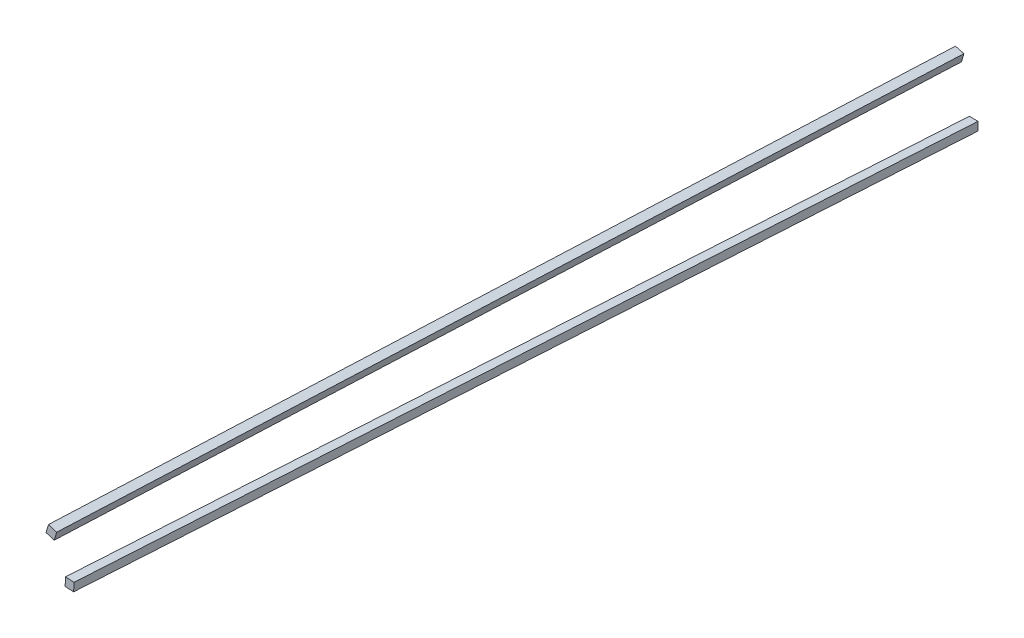
ISO-10303-21;
HEADER;
FILE_DESCRIPTION(('STEP AP214'),'2;1');
FILE_NAME('part.step','',(''),(''),'','','');
FILE_SCHEMA(('AUTOMOTIVE_DESIGN { 1 0 10303 214 1 1 1 1 }'));
ENDSEC;
DATA;
#1=APPLICATION_CONTEXT('core data for automotive mechanical design processes');
#2=APPLICATION_PROTOCOL_DEFINITION('international standard','automotive_design',2000,#1);
#3=PRODUCT_CONTEXT('',#1,'mechanical');
#4=PRODUCT('Part','Part','',(#3));
#5=PRODUCT_RELATED_PRODUCT_CATEGORY('part','',(#4));
#6=PRODUCT_DEFINITION_FORMATION('','',#4);
#7=PRODUCT_DEFINITION_CONTEXT('part definition',#1,'design');
#8=PRODUCT_DEFINITION('design','',#6,#7);
#9=PRODUCT_DEFINITION_SHAPE('','',#8);
#10=(LENGTH_UNIT() NAMED_UNIT(*) SI_UNIT(.MILLI.,.METRE.));
#11=(NAMED_UNIT(*) PLANE_ANGLE_UNIT() SI_UNIT($,.RADIAN.));
#12=(NAMED_UNIT(*) SI_UNIT($,.STERADIAN.) SOLID_ANGLE_UNIT());
#13=UNCERTAINTY_MEASURE_WITH_UNIT(LENGTH_MEASURE(1.E-05),#10,'distance_accuracy_value','');
#14=(GEOMETRIC_REPRESENTATION_CONTEXT(3) GLOBAL_UNCERTAINTY_ASSIGNED_CONTEXT((#13)) GLOBAL_UNIT_ASSIGNED_CONTEXT((#10,
#11,#12)) REPRESENTATION_CONTEXT('',''));
#15=CARTESIAN_POINT('',(0.,0.,0.));
#16=DIRECTION('',(0.,0.,1.));
#17=DIRECTION('',(1.,0.,0.));
#18=AXIS2_PLACEMENT_3D('',#15,#16,#17);
#19=CARTESIAN_POINT('',(0.,0.,0.));
#20=DIRECTION('',(0.,0.,-1.));
#21=DIRECTION('',(1.,0.,0.));
#22=AXIS2_PLACEMENT_3D('',#19,#20,#21);
#23=PLANE('',#22);
#24=CARTESIAN_POINT('',(395.313487892718,13.9070974360647,0.));
#25=CARTESIAN_POINT('',(395.311487083007,13.1133499577944,0.));
#26=CARTESIAN_POINT('',(395.309486273296,12.3196024795241,0.));
#27=CARTESIAN_POINT('',(395.305484653873,10.7321075229834,0.));
#28=CARTESIAN_POINT('',(395.303483844162,9.9383600447131,0.));
#29=CARTESIAN_POINT('',(395.301483034451,9.1446125664428,0.));
#30=B_SPLINE_CURVE_WITH_KNOTS('',3,(#24,#25,#26,#27,#28,#29),.UNSPECIFIED.,.F.,.F.,(4,2,4),(0.,
0.5,1.),.UNSPECIFIED.);
#31=CARTESIAN_POINT('',(395.301483034451,9.1446125664428,0.));
#32=VERTEX_POINT('',#31);
#33=CARTESIAN_POINT('',(395.313487892718,13.9070974360647,0.));
#34=VERTEX_POINT('',#33);
#35=EDGE_CURVE('E242',#32,#34,#30,.F.);
#36=ORIENTED_EDGE('',*,*,#35,.T.);
#37=CARTESIAN_POINT('',(400.075514439656,13.8399452487994,0.));
#38=CARTESIAN_POINT('',(399.281843348501,13.8511372800103,0.));
#39=CARTESIAN_POINT('',(398.488172257344,13.8623293112212,0.));
#40=CARTESIAN_POINT('',(396.900830075032,13.884713373643,0.));
#41=CARTESIAN_POINT('',(396.107158983875,13.8959054048538,0.));
#42=CARTESIAN_POINT('',(395.313487892718,13.9070974360647,0.));
#43=B_SPLINE_CURVE_WITH_KNOTS('',3,(#37,#38,#39,#40,#41,#42),.UNSPECIFIED.,.F.,.F.,(4,2,4),(0.,
0.5,1.),.UNSPECIFIED.);
#44=CARTESIAN_POINT('',(400.075514439656,13.8399452487994,0.));
#45=VERTEX_POINT('',#44);
#46=EDGE_CURVE('E13',#34,#45,#43,.F.);
#47=ORIENTED_EDGE('',*,*,#46,.T.);
#48=CARTESIAN_POINT('',(400.008751573171,9.10552651261769,0.));
#49=CARTESIAN_POINT('',(400.019878717586,9.89459630198132,0.));
#50=CARTESIAN_POINT('',(400.031005862,10.6836660913449,0.));
#51=CARTESIAN_POINT('',(400.053260150828,12.2618056700722,0.));
#52=CARTESIAN_POINT('',(400.064387295242,13.0508754594358,0.));
#53=CARTESIAN_POINT('',(400.075514439656,13.8399452487994,0.));
#54=B_SPLINE_CURVE_WITH_KNOTS('',3,(#48,#49,#50,#51,#52,#53),.UNSPECIFIED.,.F.,.F.,(4,2,4),(0.,
0.5,1.),.UNSPECIFIED.);
#55=CARTESIAN_POINT('',(400.008751573171,9.10552651261769,0.));
#56=VERTEX_POINT('',#55);
#57=EDGE_CURVE('E111',#45,#56,#54,.F.);
#58=ORIENTED_EDGE('',*,*,#57,.T.);
#59=CARTESIAN_POINT('',(395.301483034451,9.1446125664428,0.));
#60=CARTESIAN_POINT('',(396.086027790904,9.13809822413861,0.));
#61=CARTESIAN_POINT('',(396.870572547357,9.13158388183443,0.));
#62=CARTESIAN_POINT('',(398.439662060264,9.11855519722606,0.));
#63=CARTESIAN_POINT('',(399.224206816718,9.11204085492187,0.));
#64=CARTESIAN_POINT('',(400.008751573171,9.10552651261769,0.));
#65=B_SPLINE_CURVE_WITH_KNOTS('',3,(#59,#60,#61,#62,#63,#64),.UNSPECIFIED.,.F.,.F.,(4,2,4),(0.,
0.5,1.),.UNSPECIFIED.);
#66=EDGE_CURVE('E234',#32,#56,#65,.T.);
#67=ORIENTED_EDGE('',*,*,#66,.F.);
#68=EDGE_LOOP('',(#36,#47,#58,#67));
#69=FACE_BOUND('',#68,.T.);
#70=ADVANCED_FACE('F101',(#69),#23,.T.);
#71=CARTESIAN_POINT('',(0.,0.,469.138));
#72=DIRECTION('',(0.,0.,1.));
#73=DIRECTION('',(-1.,0.,0.));
#74=AXIS2_PLACEMENT_3D('',#71,#72,#73);
#75=PLANE('',#74);
#76=CARTESIAN_POINT('',(368.242335537773,6.77416686357147,469.138));
#77=CARTESIAN_POINT('',(367.460761179371,6.80971652101153,469.138));
#78=CARTESIAN_POINT('',(366.679186820969,6.84526617845159,469.138));
#79=CARTESIAN_POINT('',(365.116038104166,6.91636549333171,469.138));
#80=CARTESIAN_POINT('',(364.334463745764,6.95191515077178,469.138));
#81=CARTESIAN_POINT('',(363.552889387363,6.98746480821184,469.138));
#82=B_SPLINE_CURVE_WITH_KNOTS('',3,(#76,#77,#78,#79,#80,#81),.UNSPECIFIED.,.F.,.F.,(4,2,4),(0.,
0.5,1.),.UNSPECIFIED.);
#83=CARTESIAN_POINT('',(363.552889379196,6.98746480852441,469.138));
#84=VERTEX_POINT('',#83);
#85=CARTESIAN_POINT('',(368.242335537775,6.7741668636307,469.138));
#86=VERTEX_POINT('',#85);
#87=EDGE_CURVE('E165',#84,#86,#82,.F.);
#88=ORIENTED_EDGE('',*,*,#87,.T.);
#89=CARTESIAN_POINT('',(368.490941641371,11.4960846967993,469.138));
#90=CARTESIAN_POINT('',(368.449507290771,10.7090983912713,469.138));
#91=CARTESIAN_POINT('',(368.408072940172,9.92211208574317,469.138));
#92=CARTESIAN_POINT('',(368.325204238974,8.34813947468696,469.138));
#93=CARTESIAN_POINT('',(368.283769888375,7.56115316915884,469.138));
#94=CARTESIAN_POINT('',(368.242335537775,6.7741668636307,469.138));
#95=B_SPLINE_CURVE_WITH_KNOTS('',3,(#89,#90,#91,#92,#93,#94),.UNSPECIFIED.,.F.,.F.,(4,2,4),(0.,
0.5,1.),.UNSPECIFIED.);
#96=CARTESIAN_POINT('',(368.490941641371,11.4960846967993,469.138));
#97=VERTEX_POINT('',#96);
#98=EDGE_CURVE('E146',#86,#97,#95,.F.);
#99=ORIENTED_EDGE('',*,*,#98,.T.);
#100=CARTESIAN_POINT('',(363.735028676447,11.7464806234169,469.138));
#101=CARTESIAN_POINT('',(364.527680837267,11.7047479689807,469.138));
#102=CARTESIAN_POINT('',(365.320332998087,11.6630153145444,469.138));
#103=CARTESIAN_POINT('',(366.905637319729,11.5795500056719,469.138));
#104=CARTESIAN_POINT('',(367.69828948055,11.5378173512356,469.138));
#105=CARTESIAN_POINT('',(368.490941641371,11.4960846967993,469.138));
#106=B_SPLINE_CURVE_WITH_KNOTS('',3,(#100,#101,#102,#103,#104,#105),.UNSPECIFIED.,.F.,.F.,(4,2,
4),(0.,0.5,1.),.UNSPECIFIED.);
#107=CARTESIAN_POINT('',(363.735028676447,11.7464806234169,469.138));
#108=VERTEX_POINT('',#107);
#109=EDGE_CURVE('E153',#97,#108,#106,.F.);
#110=ORIENTED_EDGE('',*,*,#109,.T.);
#111=CARTESIAN_POINT('',(363.552889379196,6.98746480852441,469.138));
#112=CARTESIAN_POINT('',(363.583245928738,7.7806341110065,469.138));
#113=CARTESIAN_POINT('',(363.613602478279,8.57380341348858,469.138));
#114=CARTESIAN_POINT('',(363.674315577363,10.1601420184528,469.138));
#115=CARTESIAN_POINT('',(363.704672126905,10.9533113209348,469.138));
#116=CARTESIAN_POINT('',(363.735028676447,11.7464806234169,469.138));
#117=B_SPLINE_CURVE_WITH_KNOTS('',3,(#111,#112,#113,#114,#115,#116),.UNSPECIFIED.,.F.,.F.,(4,2,
4),(0.,0.5,1.),.UNSPECIFIED.);
#118=EDGE_CURVE('E159',#108,#84,#117,.F.);
#119=ORIENTED_EDGE('',*,*,#118,.T.);
#120=EDGE_LOOP('',(#88,#99,#110,#119));
#121=FACE_BOUND('',#120,.T.);
#122=ADVANCED_FACE('F163',(#121),#75,.T.);
#123=CARTESIAN_POINT('',(368.490941641371,11.4960846967993,469.138));
#124=CARTESIAN_POINT('',(400.075514439656,13.8399452487994,0.));
#125=CARTESIAN_POINT('',(367.69828948055,11.5378173512356,469.138));
#126=CARTESIAN_POINT('',(399.281843348501,13.8511372800103,0.));
#127=CARTESIAN_POINT('',(366.905637319729,11.5795500056719,469.138));
#128=CARTESIAN_POINT('',(398.488172257344,13.8623293112212,0.));
#129=CARTESIAN_POINT('',(365.320332998087,11.6630153145444,469.138));
#130=CARTESIAN_POINT('',(396.900830075032,13.884713373643,0.));
#131=CARTESIAN_POINT('',(364.527680837267,11.7047479689807,469.138));
#132=CARTESIAN_POINT('',(396.107158983875,13.8959054048538,0.));
#133=CARTESIAN_POINT('',(363.735028676447,11.7464806234169,469.138));
#134=CARTESIAN_POINT('',(395.313487892718,13.9070974360647,0.));
#135=B_SPLINE_SURFACE_WITH_KNOTS('',3,1,((#123,#124),(#125,#126),(#127,#128),(#129,#130),(#131,
#132),(#133,#134)),.UNSPECIFIED.,.F.,.F.,.F.,(4,2,4),(2,2),(0.,0.5,1.),(0.,1.),.UNSPECIFIED.);
#136=DIRECTION('',(-0.0671717988112607,-0.00498475412177002,0.997728972051431));
#137=VECTOR('',#136,1.);
#138=CARTESIAN_POINT('',(384.283228040514,12.6680149727994,234.569));
#139=LINE('',#138,#137);
#140=EDGE_CURVE('E125',#45,#97,#139,.T.);
#141=DIRECTION('',(0.0671589808969115,0.00459505710055014,-0.99773170578825));
#142=VECTOR('',#141,1.);
#143=CARTESIAN_POINT('',(379.524258284582,12.8267890297408,234.569));
#144=LINE('',#143,#142);
#145=EDGE_CURVE('E118',#108,#34,#144,.T.);
#146=ORIENTED_EDGE('',*,*,#109,.F.);
#147=ORIENTED_EDGE('',*,*,#140,.F.);
#148=ORIENTED_EDGE('',*,*,#46,.F.);
#149=ORIENTED_EDGE('',*,*,#145,.F.);
#150=EDGE_LOOP('',(#146,#147,#148,#149));
#151=FACE_BOUND('',#150,.T.);
#152=ADVANCED_FACE('F155',(#151),#135,.F.);
#153=CARTESIAN_POINT('',(363.735028676447,11.7464806234169,469.138));
#154=CARTESIAN_POINT('',(395.313487892718,13.9070974360647,0.));
#155=CARTESIAN_POINT('',(363.704672126905,10.9533113209348,469.138));
#156=CARTESIAN_POINT('',(395.311487083007,13.1133499577944,0.));
#157=CARTESIAN_POINT('',(363.674315577363,10.1601420184528,469.138));
#158=CARTESIAN_POINT('',(395.309486273296,12.3196024795241,0.));
#159=CARTESIAN_POINT('',(363.613602478279,8.57380341348858,469.138));
#160=CARTESIAN_POINT('',(395.305484653873,10.7321075229834,0.));
#161=CARTESIAN_POINT('',(363.583245928738,7.7806341110065,469.138));
#162=CARTESIAN_POINT('',(395.303483844162,9.9383600447131,0.));
#163=CARTESIAN_POINT('',(363.552889379196,6.98746480852441,469.138));
#164=CARTESIAN_POINT('',(395.301483034451,9.1446125664428,0.));
#165=B_SPLINE_SURFACE_WITH_KNOTS('',3,1,((#153,#154),(#155,#156),(#157,#158),(#159,#160),(#161,
#162),(#163,#164)),.UNSPECIFIED.,.F.,.F.,.F.,(4,2,4),(2,2),(0.,0.5,1.),(0.,1.),.UNSPECIFIED.);
#166=DIRECTION('',(0.067519168741487,0.0045875677218573,-0.997707430099052));
#167=VECTOR('',#166,1.);
#168=CARTESIAN_POINT('',(379.427186206823,8.0660386874836,234.569));
#169=LINE('',#168,#167);
#170=EDGE_CURVE('E245',#84,#32,#169,.T.);
#171=ORIENTED_EDGE('',*,*,#118,.F.);
#172=ORIENTED_EDGE('',*,*,#145,.T.);
#173=ORIENTED_EDGE('',*,*,#35,.F.);
#174=ORIENTED_EDGE('',*,*,#170,.F.);
#175=EDGE_LOOP('',(#171,#172,#173,#174));
#176=FACE_BOUND('',#175,.T.);
#177=ADVANCED_FACE('F264',(#176),#165,.F.);
#178=CARTESIAN_POINT('',(368.242335537775,6.7741668636307,469.138));
#179=CARTESIAN_POINT('',(400.008751573171,9.10552651261769,0.));
#180=CARTESIAN_POINT('',(368.283769888375,7.56115316915884,469.138));
#181=CARTESIAN_POINT('',(400.019878717586,9.89459630198132,0.));
#182=CARTESIAN_POINT('',(368.325204238974,8.34813947468696,469.138));
#183=CARTESIAN_POINT('',(400.031005862,10.6836660913449,0.));
#184=CARTESIAN_POINT('',(368.408072940172,9.92211208574317,469.138));
#185=CARTESIAN_POINT('',(400.053260150828,12.2618056700722,0.));
#186=CARTESIAN_POINT('',(368.449507290771,10.7090983912713,469.138));
#187=CARTESIAN_POINT('',(400.064387295242,13.0508754594358,0.));
#188=CARTESIAN_POINT('',(368.490941641371,11.4960846967993,469.138));
#189=CARTESIAN_POINT('',(400.075514439656,13.8399452487994,0.));
#190=B_SPLINE_SURFACE_WITH_KNOTS('',3,1,((#178,#179),(#180,#181),(#182,#183),(#184,#185),(#186,
#187),(#188,#189)),.UNSPECIFIED.,.F.,.F.,.F.,(4,2,4),(2,2),(0.,0.5,1.),(0.,1.),.UNSPECIFIED.);
#191=DIRECTION('',(0.067556778883899,0.0049580395891671,-0.997703111887632));
#192=VECTOR('',#191,1.);
#193=CARTESIAN_POINT('',(384.125543555472,7.93984668809458,234.569));
#194=LINE('',#193,#192);
#195=EDGE_CURVE('E244',#86,#56,#194,.T.);
#196=ORIENTED_EDGE('',*,*,#98,.F.);
#197=ORIENTED_EDGE('',*,*,#195,.T.);
#198=ORIENTED_EDGE('',*,*,#57,.F.);
#199=ORIENTED_EDGE('',*,*,#140,.T.);
#200=EDGE_LOOP('',(#196,#197,#198,#199));
#201=FACE_BOUND('',#200,.T.);
#202=ADVANCED_FACE('F144',(#201),#190,.F.);
#203=CARTESIAN_POINT('',(363.552889387363,6.98746480821184,469.138));
#204=CARTESIAN_POINT('',(395.301483034451,9.1446125664428,0.));
#205=CARTESIAN_POINT('',(364.334463745764,6.95191515077178,469.138));
#206=CARTESIAN_POINT('',(396.086027790904,9.13809822413861,0.));
#207=CARTESIAN_POINT('',(365.116038104166,6.91636549333171,469.138));
#208=CARTESIAN_POINT('',(396.870572547357,9.13158388183443,0.));
#209=CARTESIAN_POINT('',(366.679186820969,6.84526617845159,469.138));
#210=CARTESIAN_POINT('',(398.439662060264,9.11855519722606,0.));
#211=CARTESIAN_POINT('',(367.460761179371,6.80971652101153,469.138));
#212=CARTESIAN_POINT('',(399.224206816718,9.11204085492187,0.));
#213=CARTESIAN_POINT('',(368.242335537773,6.77416686357147,469.138));
#214=CARTESIAN_POINT('',(400.008751573171,9.10552651261769,0.));
#215=B_SPLINE_SURFACE_WITH_KNOTS('',3,1,((#203,#204),(#205,#206),(#207,#208),(#209,#210),(#211,
#212),(#213,#214)),.UNSPECIFIED.,.F.,.F.,.F.,(4,2,4),(2,2),(0.,0.5,1.),(0.,1.),.UNSPECIFIED.);
#216=ORIENTED_EDGE('',*,*,#87,.F.);
#217=ORIENTED_EDGE('',*,*,#170,.T.);
#218=ORIENTED_EDGE('',*,*,#66,.T.);
#219=ORIENTED_EDGE('',*,*,#195,.F.);
#220=EDGE_LOOP('',(#216,#217,#218,#219));
#221=FACE_BOUND('',#220,.T.);
#222=ADVANCED_FACE('F263',(#221),#215,.F.);
#223=CLOSED_SHELL('',(#70,#122,#152,#177,#202,#222));
#224=MANIFOLD_SOLID_BREP('B2',#223);
#225=CARTESIAN_POINT('',(0.,0.,0.));
#226=DIRECTION('',(0.,0.,-1.));
#227=DIRECTION('',(1.,0.,0.));
#228=AXIS2_PLACEMENT_3D('',#225,#226,#227);
#229=PLANE('',#228);
#230=CARTESIAN_POINT('',(392.246798260659,42.3975737675759,0.));
#231=CARTESIAN_POINT('',(391.4710230142,42.611059847223,0.));
#232=CARTESIAN_POINT('',(390.695247767741,42.82454592687,0.));
#233=CARTESIAN_POINT('',(389.143697274823,43.251518086164,0.));
#234=CARTESIAN_POINT('',(388.367922028364,43.4650041658109,0.));
#235=CARTESIAN_POINT('',(387.592146781905,43.6784902454578,0.));
#236=B_SPLINE_CURVE_WITH_KNOTS('',3,(#230,#231,#232,#233,#234,#235),.UNSPECIFIED.,.F.,.F.,(4,2,
4),(0.,0.5,1.),.UNSPECIFIED.);
#237=CARTESIAN_POINT('',(387.592146781905,43.6784902454578,0.));
#238=VERTEX_POINT('',#237);
#239=CARTESIAN_POINT('',(392.246798260659,42.3975737675759,0.));
#240=VERTEX_POINT('',#239);
#241=EDGE_CURVE('E579',#238,#240,#236,.F.);
#242=ORIENTED_EDGE('',*,*,#241,.T.);
#243=CARTESIAN_POINT('',(390.960475862964,37.8460660672843,0.));
#244=CARTESIAN_POINT('',(391.174862929247,38.6046506839998,0.));
#245=CARTESIAN_POINT('',(391.389249995529,39.3632353007152,0.));
#246=CARTESIAN_POINT('',(391.818024128094,40.8804045341457,0.));
#247=CARTESIAN_POINT('',(392.032411194377,41.6389891508608,0.));
#248=CARTESIAN_POINT('',(392.246798260659,42.3975737675759,0.));
#249=B_SPLINE_CURVE_WITH_KNOTS('',3,(#243,#244,#245,#246,#247,#248),.UNSPECIFIED.,.F.,.F.,(4,2,
4),(0.,0.5,1.),.UNSPECIFIED.);
#250=CARTESIAN_POINT('',(390.960475862964,37.8460660672843,0.));
#251=VERTEX_POINT('',#250);
#252=EDGE_CURVE('E99',#251,#240,#249,.T.);
#253=ORIENTED_EDGE('',*,*,#252,.F.);
#254=CARTESIAN_POINT('',(386.360099239292,39.0781136192739,0.));
#255=CARTESIAN_POINT('',(387.126828676571,38.8727723606088,0.));
#256=CARTESIAN_POINT('',(387.89355811385,38.6674311019438,0.));
#257=CARTESIAN_POINT('',(389.427016988408,38.256748584614,0.));
#258=CARTESIAN_POINT('',(390.193746425686,38.0514073259491,0.));
#259=CARTESIAN_POINT('',(390.960475862964,37.8460660672843,0.));
#260=B_SPLINE_CURVE_WITH_KNOTS('',3,(#254,#255,#256,#257,#258,#259),.UNSPECIFIED.,.F.,.F.,(4,2,
4),(0.,0.5,1.),.UNSPECIFIED.);
#261=CARTESIAN_POINT('',(386.360099239292,39.078113619274,0.));
#262=VERTEX_POINT('',#261);
#263=EDGE_CURVE('E444',#262,#251,#260,.T.);
#264=ORIENTED_EDGE('',*,*,#263,.F.);
#265=CARTESIAN_POINT('',(387.592146781905,43.6784902454578,0.));
#266=CARTESIAN_POINT('',(387.386805524803,42.9117608077606,0.));
#267=CARTESIAN_POINT('',(387.181464267701,42.1450313700633,0.));
#268=CARTESIAN_POINT('',(386.770781753496,40.6115724946687,0.));
#269=CARTESIAN_POINT('',(386.565440496394,39.8448430569714,0.));
#270=CARTESIAN_POINT('',(386.360099239292,39.078113619274,0.));
#271=B_SPLINE_CURVE_WITH_KNOTS('',3,(#265,#266,#267,#268,#269,#270),.UNSPECIFIED.,.F.,.F.,(4,2,
4),(0.,0.5,1.),.UNSPECIFIED.);
#272=EDGE_CURVE('E485',#238,#262,#271,.T.);
#273=ORIENTED_EDGE('',*,*,#272,.F.);
#274=EDGE_LOOP('',(#242,#253,#264,#273));
#275=FACE_BOUND('',#274,.T.);
#276=ADVANCED_FACE('F434',(#275),#229,.T.);
#277=CARTESIAN_POINT('',(0.,0.,469.138));
#278=DIRECTION('',(0.,0.,1.));
#279=DIRECTION('',(-1.,0.,0.));
#280=AXIS2_PLACEMENT_3D('',#277,#278,#279);
#281=PLANE('',#280);
#282=CARTESIAN_POINT('',(354.3208374344,32.1244273965259,469.138));
#283=CARTESIAN_POINT('',(355.07880983132,31.888709410133,469.138));
#284=CARTESIAN_POINT('',(355.83678222824,31.6529914237401,469.138));
#285=CARTESIAN_POINT('',(357.35272702208,31.1815554509543,469.138));
#286=CARTESIAN_POINT('',(358.110699419001,30.9458374645614,469.138));
#287=CARTESIAN_POINT('',(358.868671815921,30.7101194781685,469.138));
#288=B_SPLINE_CURVE_WITH_KNOTS('',3,(#282,#283,#284,#285,#286,#287),.UNSPECIFIED.,.F.,.F.,(4,2,
4),(0.,0.5,1.),.UNSPECIFIED.);
#289=CARTESIAN_POINT('',(358.868671815921,30.7101194781685,469.138));
#290=VERTEX_POINT('',#289);
#291=CARTESIAN_POINT('',(354.32083743442,32.1244273965907,469.138));
#292=VERTEX_POINT('',#291);
#293=EDGE_CURVE('E503',#290,#292,#288,.F.);
#294=ORIENTED_EDGE('',*,*,#293,.T.);
#295=CARTESIAN_POINT('',(352.945516306707,27.5648333307044,469.138));
#296=CARTESIAN_POINT('',(353.174736494659,28.3247656750187,469.138));
#297=CARTESIAN_POINT('',(353.403956682611,29.0846980193331,469.138));
#298=CARTESIAN_POINT('',(353.862397058516,30.6045627079619,469.138));
#299=CARTESIAN_POINT('',(354.091617246468,31.3644950522763,469.138));
#300=CARTESIAN_POINT('',(354.32083743442,32.1244273965907,469.138));
#301=B_SPLINE_CURVE_WITH_KNOTS('',3,(#295,#296,#297,#298,#299,#300),.UNSPECIFIED.,.F.,.F.,(4,2,
4),(0.,0.5,1.),.UNSPECIFIED.);
#302=CARTESIAN_POINT('',(352.945516306707,27.5648333307043,469.138));
#303=VERTEX_POINT('',#302);
#304=EDGE_CURVE('E481',#292,#303,#301,.F.);
#305=ORIENTED_EDGE('',*,*,#304,.T.);
#306=CARTESIAN_POINT('',(357.505110372594,26.1895122029914,469.138));
#307=CARTESIAN_POINT('',(356.745178028279,26.4187323909436,469.138));
#308=CARTESIAN_POINT('',(355.985245683965,26.6479525788957,469.138));
#309=CARTESIAN_POINT('',(354.465380995336,27.1063929548,469.138));
#310=CARTESIAN_POINT('',(353.705448651022,27.3356131427522,469.138));
#311=CARTESIAN_POINT('',(352.945516306707,27.5648333307043,469.138));
#312=B_SPLINE_CURVE_WITH_KNOTS('',3,(#306,#307,#308,#309,#310,#311),.UNSPECIFIED.,.F.,.F.,(4,2,
4),(0.,0.5,1.),.UNSPECIFIED.);
#313=CARTESIAN_POINT('',(357.505110372594,26.1895122029914,469.138));
#314=VERTEX_POINT('',#313);
#315=EDGE_CURVE('E492',#303,#314,#312,.F.);
#316=ORIENTED_EDGE('',*,*,#315,.T.);
#317=CARTESIAN_POINT('',(358.868671821987,30.7101194763388,469.138));
#318=CARTESIAN_POINT('',(358.641411580422,29.9566849307809,469.138));
#319=CARTESIAN_POINT('',(358.414151338856,29.203250385223,469.138));
#320=CARTESIAN_POINT('',(357.959630855725,27.6963812941073,469.138));
#321=CARTESIAN_POINT('',(357.732370614159,26.9429467485494,469.138));
#322=CARTESIAN_POINT('',(357.505110372593,26.1895122029915,469.138));
#323=B_SPLINE_CURVE_WITH_KNOTS('',3,(#317,#318,#319,#320,#321,#322),.UNSPECIFIED.,.F.,.F.,(4,2,
4),(0.,0.5,1.),.UNSPECIFIED.);
#324=EDGE_CURVE('E498',#314,#290,#323,.F.);
#325=ORIENTED_EDGE('',*,*,#324,.T.);
#326=EDGE_LOOP('',(#294,#305,#316,#325));
#327=FACE_BOUND('',#326,.T.);
#328=ADVANCED_FACE('F502',(#327),#281,.T.);
#329=CARTESIAN_POINT('',(358.868671815921,30.7101194781685,469.138));
#330=CARTESIAN_POINT('',(392.246798260659,42.3975737675759,0.));
#331=CARTESIAN_POINT('',(358.110699419001,30.9458374645614,469.138));
#332=CARTESIAN_POINT('',(391.4710230142,42.611059847223,0.));
#333=CARTESIAN_POINT('',(357.35272702208,31.1815554509543,469.138));
#334=CARTESIAN_POINT('',(390.695247767741,42.82454592687,0.));
#335=CARTESIAN_POINT('',(355.83678222824,31.6529914237401,469.138));
#336=CARTESIAN_POINT('',(389.143697274823,43.251518086164,0.));
#337=CARTESIAN_POINT('',(355.07880983132,31.888709410133,469.138));
#338=CARTESIAN_POINT('',(388.367922028364,43.4650041658109,0.));
#339=CARTESIAN_POINT('',(354.3208374344,32.1244273965259,469.138));
#340=CARTESIAN_POINT('',(387.592146781905,43.6784902454578,0.));
#341=B_SPLINE_SURFACE_WITH_KNOTS('',3,1,((#329,#330),(#331,#332),(#333,#334),(#335,#336),(#337,
#338),(#339,#340)),.UNSPECIFIED.,.F.,.F.,.F.,(4,2,4),(2,2),(0.,0.5,1.),(0.,1.),.UNSPECIFIED.);
#342=DIRECTION('',(-0.0709464821029257,-0.0248421303078536,0.997170730235794));
#343=VECTOR('',#342,1.);
#344=CARTESIAN_POINT('',(375.55773503829,36.5538466228722,234.569));
#345=LINE('',#344,#343);
#346=EDGE_CURVE('E451',#240,#290,#345,.T.);
#347=DIRECTION('',(0.0707210709308886,0.0245591686742715,-0.997193751163943));
#348=VECTOR('',#347,1.);
#349=CARTESIAN_POINT('',(370.956492108153,37.9014588209918,234.569));
#350=LINE('',#349,#348);
#351=EDGE_CURVE('E489',#292,#238,#350,.T.);
#352=ORIENTED_EDGE('',*,*,#293,.F.);
#353=ORIENTED_EDGE('',*,*,#346,.F.);
#354=ORIENTED_EDGE('',*,*,#241,.F.);
#355=ORIENTED_EDGE('',*,*,#351,.F.);
#356=EDGE_LOOP('',(#352,#353,#354,#355));
#357=FACE_BOUND('',#356,.T.);
#358=ADVANCED_FACE('F522',(#357),#341,.F.);
#359=CARTESIAN_POINT('',(354.32083743442,32.1244273965907,469.138));
#360=CARTESIAN_POINT('',(387.592146781905,43.6784902454578,0.));
#361=CARTESIAN_POINT('',(354.091617246468,31.3644950522763,469.138));
#362=CARTESIAN_POINT('',(387.386805524803,42.9117608077606,0.));
#363=CARTESIAN_POINT('',(353.862397058516,30.6045627079619,469.138));
#364=CARTESIAN_POINT('',(387.181464267701,42.1450313700633,0.));
#365=CARTESIAN_POINT('',(353.403956682611,29.0846980193331,469.138));
#366=CARTESIAN_POINT('',(386.770781753496,40.6115724946687,0.));
#367=CARTESIAN_POINT('',(353.174736494659,28.3247656750187,469.138));
#368=CARTESIAN_POINT('',(386.565440496394,39.8448430569714,0.));
#369=CARTESIAN_POINT('',(352.945516306707,27.5648333307044,469.138));
#370=CARTESIAN_POINT('',(386.360099239292,39.078113619274,0.));
#371=B_SPLINE_SURFACE_WITH_KNOTS('',3,1,((#359,#360),(#361,#362),(#363,#364),(#365,#366),(#367,
#368),(#369,#370)),.UNSPECIFIED.,.F.,.F.,.F.,(4,2,4),(2,2),(0.,0.5,1.),(0.,1.),.UNSPECIFIED.);
#372=DIRECTION('',(0.0710242294177518,0.0244720055975575,-0.997174347733458));
#373=VECTOR('',#372,1.);
#374=CARTESIAN_POINT('',(369.652807772999,33.3214734749892,234.569));
#375=LINE('',#374,#373);
#376=EDGE_CURVE('E477',#303,#262,#375,.T.);
#377=ORIENTED_EDGE('',*,*,#304,.F.);
#378=ORIENTED_EDGE('',*,*,#351,.T.);
#379=ORIENTED_EDGE('',*,*,#272,.T.);
#380=ORIENTED_EDGE('',*,*,#376,.F.);
#381=EDGE_LOOP('',(#377,#378,#379,#380));
#382=FACE_BOUND('',#381,.T.);
#383=ADVANCED_FACE('F479',(#382),#371,.F.);
#384=CARTESIAN_POINT('',(357.505110372593,26.1895122029915,469.138));
#385=CARTESIAN_POINT('',(390.960475862964,37.8460660672843,0.));
#386=CARTESIAN_POINT('',(357.732370614159,26.9429467485494,469.138));
#387=CARTESIAN_POINT('',(391.174862929247,38.6046506839998,0.));
#388=CARTESIAN_POINT('',(357.959630855725,27.6963812941073,469.138));
#389=CARTESIAN_POINT('',(391.389249995529,39.3632353007152,0.));
#390=CARTESIAN_POINT('',(358.414151338856,29.203250385223,469.138));
#391=CARTESIAN_POINT('',(391.818024128094,40.8804045341457,0.));
#392=CARTESIAN_POINT('',(358.641411580422,29.9566849307809,469.138));
#393=CARTESIAN_POINT('',(392.032411194377,41.6389891508608,0.));
#394=CARTESIAN_POINT('',(358.868671821987,30.7101194763388,469.138));
#395=CARTESIAN_POINT('',(392.246798260659,42.3975737675759,0.));
#396=B_SPLINE_SURFACE_WITH_KNOTS('',3,1,((#384,#385),(#386,#387),(#388,#389),(#390,#391),(#392,
#393),(#394,#395)),.UNSPECIFIED.,.F.,.F.,.F.,(4,2,4),(2,2),(0.,0.5,1.),(0.,1.),.UNSPECIFIED.);
#397=DIRECTION('',(0.0711099432998514,0.0247762017306346,-0.997160727160719));
#398=VECTOR('',#397,1.);
#399=CARTESIAN_POINT('',(374.232793117779,32.0177891351379,234.569));
#400=LINE('',#399,#398);
#401=EDGE_CURVE('E457',#314,#251,#400,.T.);
#402=ORIENTED_EDGE('',*,*,#324,.F.);
#403=ORIENTED_EDGE('',*,*,#401,.T.);
#404=ORIENTED_EDGE('',*,*,#252,.T.);
#405=ORIENTED_EDGE('',*,*,#346,.T.);
#406=EDGE_LOOP('',(#402,#403,#404,#405));
#407=FACE_BOUND('',#406,.T.);
#408=ADVANCED_FACE('F593',(#407),#396,.F.);
#409=CARTESIAN_POINT('',(352.945516306707,27.5648333307043,469.138));
#410=CARTESIAN_POINT('',(386.360099239292,39.0781136192739,0.));
#411=CARTESIAN_POINT('',(353.705448651022,27.3356131427522,469.138));
#412=CARTESIAN_POINT('',(387.126828676571,38.8727723606088,0.));
#413=CARTESIAN_POINT('',(354.465380995336,27.1063929548,469.138));
#414=CARTESIAN_POINT('',(387.89355811385,38.6674311019438,0.));
#415=CARTESIAN_POINT('',(355.985245683965,26.6479525788957,469.138));
#416=CARTESIAN_POINT('',(389.427016988408,38.256748584614,0.));
#417=CARTESIAN_POINT('',(356.745178028279,26.4187323909436,469.138));
#418=CARTESIAN_POINT('',(390.193746425686,38.0514073259491,0.));
#419=CARTESIAN_POINT('',(357.505110372594,26.1895122029914,469.138));
#420=CARTESIAN_POINT('',(390.960475862964,37.8460660672843,0.));
#421=B_SPLINE_SURFACE_WITH_KNOTS('',3,1,((#409,#410),(#411,#412),(#413,#414),(#415,#416),(#417,
#418),(#419,#420)),.UNSPECIFIED.,.F.,.F.,.F.,(4,2,4),(2,2),(0.,0.5,1.),(0.,1.),.UNSPECIFIED.);
#422=ORIENTED_EDGE('',*,*,#315,.F.);
#423=ORIENTED_EDGE('',*,*,#376,.T.);
#424=ORIENTED_EDGE('',*,*,#263,.T.);
#425=ORIENTED_EDGE('',*,*,#401,.F.);
#426=EDGE_LOOP('',(#422,#423,#424,#425));
#427=FACE_BOUND('',#426,.T.);
#428=ADVANCED_FACE('F494',(#427),#421,.F.);
#429=CLOSED_SHELL('',(#276,#328,#358,#383,#408,#428));
#430=MANIFOLD_SOLID_BREP('B7',#429);
#431=ADVANCED_BREP_SHAPE_REPRESENTATION('',(#18,#224,#430),#14);
#432=SHAPE_DEFINITION_REPRESENTATION(#9,#431);
ENDSEC;
END-ISO-10303-21;
